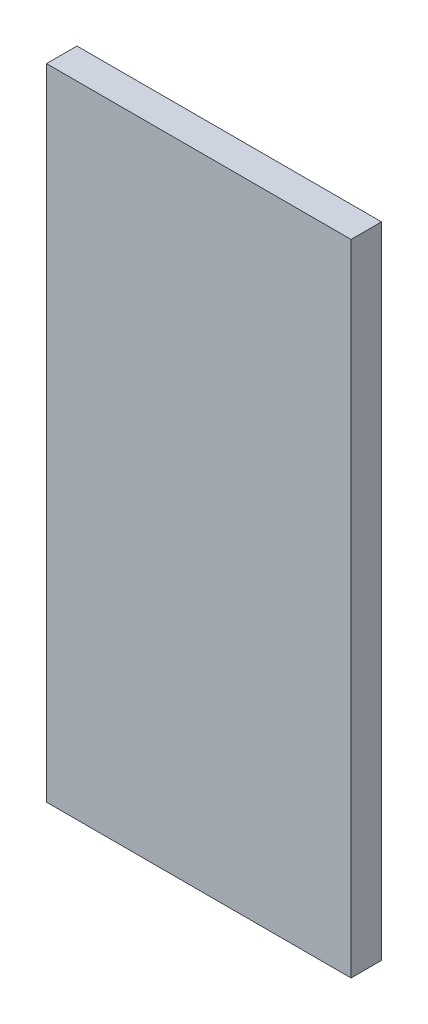
ISO-10303-21;
HEADER;
FILE_DESCRIPTION(('STEP AP214'),'2;1');
FILE_NAME('part.step','',(''),(''),'','','');
FILE_SCHEMA(('AUTOMOTIVE_DESIGN { 1 0 10303 214 1 1 1 1 }'));
ENDSEC;
DATA;
#1=APPLICATION_CONTEXT('core data for automotive mechanical design processes');
#2=APPLICATION_PROTOCOL_DEFINITION('international standard','automotive_design',2000,#1);
#3=PRODUCT_CONTEXT('',#1,'mechanical');
#4=PRODUCT('Part','Part','',(#3));
#5=PRODUCT_RELATED_PRODUCT_CATEGORY('part','',(#4));
#6=PRODUCT_DEFINITION_FORMATION('','',#4);
#7=PRODUCT_DEFINITION_CONTEXT('part definition',#1,'design');
#8=PRODUCT_DEFINITION('design','',#6,#7);
#9=PRODUCT_DEFINITION_SHAPE('','',#8);
#10=(LENGTH_UNIT() NAMED_UNIT(*) SI_UNIT(.MILLI.,.METRE.));
#11=(NAMED_UNIT(*) PLANE_ANGLE_UNIT() SI_UNIT($,.RADIAN.));
#12=(NAMED_UNIT(*) SI_UNIT($,.STERADIAN.) SOLID_ANGLE_UNIT());
#13=UNCERTAINTY_MEASURE_WITH_UNIT(LENGTH_MEASURE(1.E-05),#10,'distance_accuracy_value','');
#14=(GEOMETRIC_REPRESENTATION_CONTEXT(3) GLOBAL_UNCERTAINTY_ASSIGNED_CONTEXT((#13)) GLOBAL_UNIT_ASSIGNED_CONTEXT((#10,
#11,#12)) REPRESENTATION_CONTEXT('',''));
#15=CARTESIAN_POINT('',(0.,0.,0.));
#16=DIRECTION('',(0.,0.,1.));
#17=DIRECTION('',(1.,0.,0.));
#18=AXIS2_PLACEMENT_3D('',#15,#16,#17);
#19=CARTESIAN_POINT('',(0.,0.,100.));
#20=DIRECTION('',(1.,0.,0.));
#21=DIRECTION('',(0.,1.,0.));
#22=AXIS2_PLACEMENT_3D('',#19,#20,#21);
#23=PLANE('',#22);
#24=DIRECTION('',(0.,-1.,0.));
#25=VECTOR('',#24,1.);
#26=CARTESIAN_POINT('',(0.,0.,0.));
#27=LINE('',#26,#25);
#28=CARTESIAN_POINT('',(0.,0.,0.));
#29=VERTEX_POINT('',#28);
#30=CARTESIAN_POINT('',(2.57175827820944E-13,-2100.,0.));
#31=VERTEX_POINT('',#30);
#32=EDGE_CURVE('E98',#29,#31,#27,.T.);
#33=ORIENTED_EDGE('',*,*,#32,.T.);
#34=DIRECTION('',(0.,0.,-1.));
#35=VECTOR('',#34,1.);
#36=CARTESIAN_POINT('',(2.57175827820944E-13,-2100.,100.));
#37=LINE('',#36,#35);
#38=CARTESIAN_POINT('',(2.57175827820944E-13,-2100.,100.));
#39=VERTEX_POINT('',#38);
#40=EDGE_CURVE('E11',#39,#31,#37,.T.);
#41=ORIENTED_EDGE('',*,*,#40,.F.);
#42=DIRECTION('',(0.,-1.,0.));
#43=VECTOR('',#42,1.);
#44=CARTESIAN_POINT('',(0.,0.,100.));
#45=LINE('',#44,#43);
#46=CARTESIAN_POINT('',(0.,0.,100.));
#47=VERTEX_POINT('',#46);
#48=EDGE_CURVE('E86',#47,#39,#45,.T.);
#49=ORIENTED_EDGE('',*,*,#48,.F.);
#50=DIRECTION('',(0.,0.,-1.));
#51=VECTOR('',#50,1.);
#52=CARTESIAN_POINT('',(0.,0.,100.));
#53=LINE('',#52,#51);
#54=EDGE_CURVE('E94',#47,#29,#53,.T.);
#55=ORIENTED_EDGE('',*,*,#54,.T.);
#56=EDGE_LOOP('',(#33,#41,#49,#55));
#57=FACE_BOUND('',#56,.T.);
#58=ADVANCED_FACE('F35',(#57),#23,.F.);
#59=CARTESIAN_POINT('',(2.57175827820944E-13,-2100.,100.));
#60=DIRECTION('',(0.,1.,0.));
#61=DIRECTION('',(0.,0.,1.));
#62=AXIS2_PLACEMENT_3D('',#59,#60,#61);
#63=PLANE('',#62);
#64=DIRECTION('',(1.,0.,0.));
#65=VECTOR('',#64,1.);
#66=CARTESIAN_POINT('',(2.57175827820944E-13,-2100.,0.));
#67=LINE('',#66,#65);
#68=CARTESIAN_POINT('',(1000.,-2100.,0.));
#69=VERTEX_POINT('',#68);
#70=EDGE_CURVE('E90',#31,#69,#67,.T.);
#71=ORIENTED_EDGE('',*,*,#70,.T.);
#72=DIRECTION('',(0.,0.,-1.));
#73=VECTOR('',#72,1.);
#74=CARTESIAN_POINT('',(1000.,-2100.,100.));
#75=LINE('',#74,#73);
#76=CARTESIAN_POINT('',(1000.,-2100.,100.));
#77=VERTEX_POINT('',#76);
#78=EDGE_CURVE('E43',#77,#69,#75,.T.);
#79=ORIENTED_EDGE('',*,*,#78,.F.);
#80=DIRECTION('',(1.,0.,0.));
#81=VECTOR('',#80,1.);
#82=CARTESIAN_POINT('',(2.57175827820944E-13,-2100.,100.));
#83=LINE('',#82,#81);
#84=EDGE_CURVE('E81',#39,#77,#83,.T.);
#85=ORIENTED_EDGE('',*,*,#84,.F.);
#86=ORIENTED_EDGE('',*,*,#40,.T.);
#87=EDGE_LOOP('',(#71,#79,#85,#86));
#88=FACE_BOUND('',#87,.T.);
#89=ADVANCED_FACE('F89',(#88),#63,.F.);
#90=CARTESIAN_POINT('',(1000.,0.,100.));
#91=DIRECTION('',(-1.,0.,0.));
#92=DIRECTION('',(0.,0.,1.));
#93=AXIS2_PLACEMENT_3D('',#90,#91,#92);
#94=PLANE('',#93);
#95=DIRECTION('',(0.,1.,0.));
#96=VECTOR('',#95,1.);
#97=CARTESIAN_POINT('',(1000.,0.,0.));
#98=LINE('',#97,#96);
#99=CARTESIAN_POINT('',(1000.,0.,0.));
#100=VERTEX_POINT('',#99);
#101=EDGE_CURVE('E68',#69,#100,#98,.T.);
#102=ORIENTED_EDGE('',*,*,#101,.T.);
#103=DIRECTION('',(0.,0.,-1.));
#104=VECTOR('',#103,1.);
#105=CARTESIAN_POINT('',(1000.,0.,100.));
#106=LINE('',#105,#104);
#107=CARTESIAN_POINT('',(1000.,0.,100.));
#108=VERTEX_POINT('',#107);
#109=EDGE_CURVE('E91',#108,#100,#106,.T.);
#110=ORIENTED_EDGE('',*,*,#109,.F.);
#111=DIRECTION('',(0.,1.,0.));
#112=VECTOR('',#111,1.);
#113=CARTESIAN_POINT('',(1000.,0.,100.));
#114=LINE('',#113,#112);
#115=EDGE_CURVE('E84',#77,#108,#114,.T.);
#116=ORIENTED_EDGE('',*,*,#115,.F.);
#117=ORIENTED_EDGE('',*,*,#78,.T.);
#118=EDGE_LOOP('',(#102,#110,#116,#117));
#119=FACE_BOUND('',#118,.T.);
#120=ADVANCED_FACE('F92',(#119),#94,.F.);
#121=CARTESIAN_POINT('',(0.,0.,100.));
#122=DIRECTION('',(0.,-1.,0.));
#123=DIRECTION('',(0.,0.,-1.));
#124=AXIS2_PLACEMENT_3D('',#121,#122,#123);
#125=PLANE('',#124);
#126=DIRECTION('',(-1.,0.,0.));
#127=VECTOR('',#126,1.);
#128=CARTESIAN_POINT('',(0.,0.,0.));
#129=LINE('',#128,#127);
#130=EDGE_CURVE('E74',#100,#29,#129,.T.);
#131=ORIENTED_EDGE('',*,*,#130,.T.);
#132=ORIENTED_EDGE('',*,*,#54,.F.);
#133=DIRECTION('',(-1.,0.,0.));
#134=VECTOR('',#133,1.);
#135=CARTESIAN_POINT('',(0.,0.,100.));
#136=LINE('',#135,#134);
#137=EDGE_CURVE('E51',#108,#47,#136,.T.);
#138=ORIENTED_EDGE('',*,*,#137,.F.);
#139=ORIENTED_EDGE('',*,*,#109,.T.);
#140=EDGE_LOOP('',(#131,#132,#138,#139));
#141=FACE_BOUND('',#140,.T.);
#142=ADVANCED_FACE('F105',(#141),#125,.F.);
#143=CARTESIAN_POINT('',(0.,0.,100.));
#144=DIRECTION('',(0.,0.,1.));
#145=DIRECTION('',(1.,0.,0.));
#146=AXIS2_PLACEMENT_3D('',#143,#144,#145);
#147=PLANE('',#146);
#148=ORIENTED_EDGE('',*,*,#48,.T.);
#149=ORIENTED_EDGE('',*,*,#84,.T.);
#150=ORIENTED_EDGE('',*,*,#115,.T.);
#151=ORIENTED_EDGE('',*,*,#137,.T.);
#152=EDGE_LOOP('',(#148,#149,#150,#151));
#153=FACE_BOUND('',#152,.T.);
#154=ADVANCED_FACE('F82',(#153),#147,.T.);
#155=CARTESIAN_POINT('',(0.,0.,0.));
#156=DIRECTION('',(0.,0.,1.));
#157=DIRECTION('',(1.,0.,0.));
#158=AXIS2_PLACEMENT_3D('',#155,#156,#157);
#159=PLANE('',#158);
#160=ORIENTED_EDGE('',*,*,#32,.F.);
#161=ORIENTED_EDGE('',*,*,#130,.F.);
#162=ORIENTED_EDGE('',*,*,#101,.F.);
#163=ORIENTED_EDGE('',*,*,#70,.F.);
#164=EDGE_LOOP('',(#160,#161,#162,#163));
#165=FACE_BOUND('',#164,.T.);
#166=ADVANCED_FACE('F108',(#165),#159,.F.);
#167=CLOSED_SHELL('',(#58,#89,#120,#142,#154,#166));
#168=MANIFOLD_SOLID_BREP('B2',#167);
#169=ADVANCED_BREP_SHAPE_REPRESENTATION('',(#18,#168),#14);
#170=SHAPE_DEFINITION_REPRESENTATION(#9,#169);
ENDSEC;
END-ISO-10303-21;
